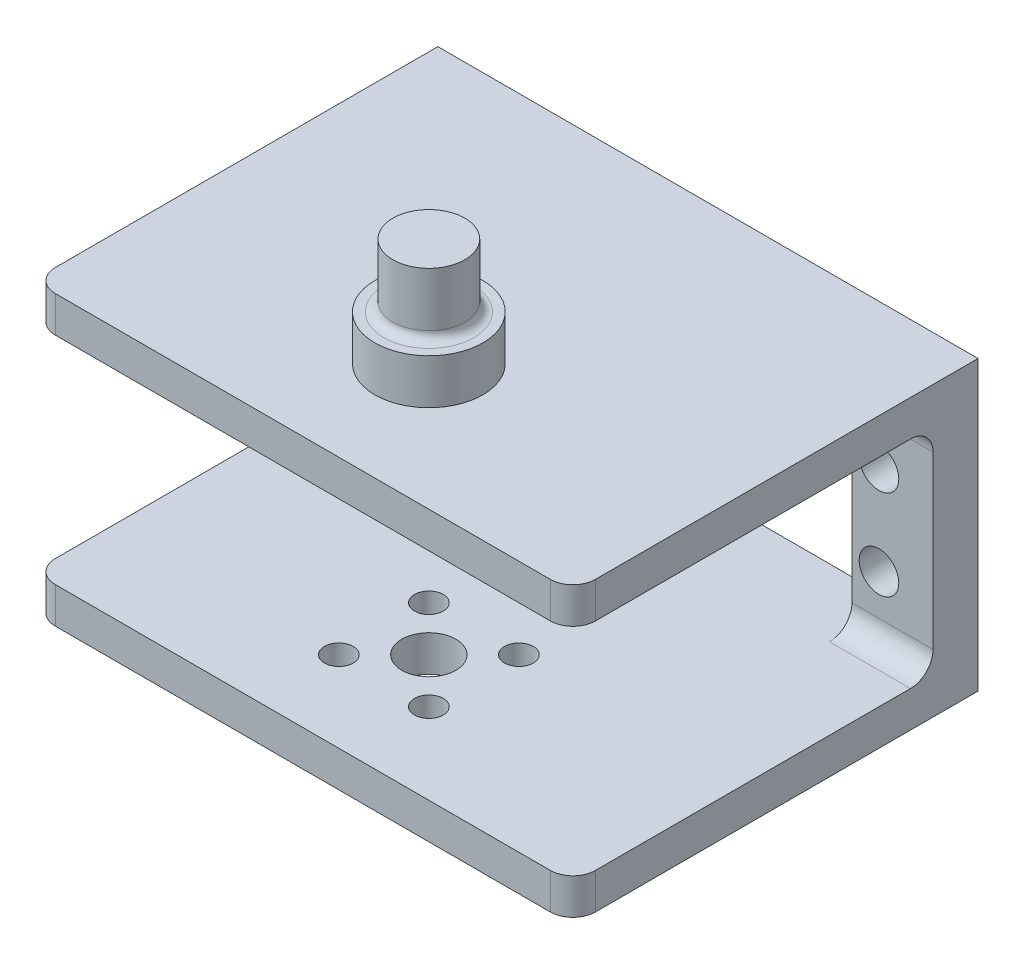
ISO-10303-21;
HEADER;
FILE_DESCRIPTION(('STEP AP214'),'2;1');
FILE_NAME('part.step','',(''),(''),'','','');
FILE_SCHEMA(('AUTOMOTIVE_DESIGN { 1 0 10303 214 1 1 1 1 }'));
ENDSEC;
DATA;
#1=APPLICATION_CONTEXT('core data for automotive mechanical design processes');
#2=APPLICATION_PROTOCOL_DEFINITION('international standard','automotive_design',2000,#1);
#3=PRODUCT_CONTEXT('',#1,'mechanical');
#4=PRODUCT('Part','Part','',(#3));
#5=PRODUCT_RELATED_PRODUCT_CATEGORY('part','',(#4));
#6=PRODUCT_DEFINITION_FORMATION('','',#4);
#7=PRODUCT_DEFINITION_CONTEXT('part definition',#1,'design');
#8=PRODUCT_DEFINITION('design','',#6,#7);
#9=PRODUCT_DEFINITION_SHAPE('','',#8);
#10=(LENGTH_UNIT() NAMED_UNIT(*) SI_UNIT(.MILLI.,.METRE.));
#11=(NAMED_UNIT(*) PLANE_ANGLE_UNIT() SI_UNIT($,.RADIAN.));
#12=(NAMED_UNIT(*) SI_UNIT($,.STERADIAN.) SOLID_ANGLE_UNIT());
#13=UNCERTAINTY_MEASURE_WITH_UNIT(LENGTH_MEASURE(1.E-05),#10,'distance_accuracy_value','');
#14=(GEOMETRIC_REPRESENTATION_CONTEXT(3) GLOBAL_UNCERTAINTY_ASSIGNED_CONTEXT((#13)) GLOBAL_UNIT_ASSIGNED_CONTEXT((#10,
#11,#12)) REPRESENTATION_CONTEXT('',''));
#15=CARTESIAN_POINT('',(0.,0.,0.));
#16=DIRECTION('',(0.,0.,1.));
#17=DIRECTION('',(1.,0.,0.));
#18=AXIS2_PLACEMENT_3D('',#15,#16,#17);
#19=CARTESIAN_POINT('',(0.,7.68517619511929,45.));
#20=DIRECTION('',(0.,1.,0.));
#21=DIRECTION('',(-1.,0.,0.));
#22=AXIS2_PLACEMENT_3D('',#19,#20,#21);
#23=PLANE('',#22);
#24=CARTESIAN_POINT('',(-87.025641025641,7.68517619511928,36.));
#25=DIRECTION('',(0.,1.,0.));
#26=DIRECTION('',(1.,0.,0.));
#27=AXIS2_PLACEMENT_3D('',#24,#25,#26);
#28=CIRCLE('',#27,1.60000000000001);
#29=CARTESIAN_POINT('',(-85.4256410256409,7.68517619511928,36.));
#30=VERTEX_POINT('',#29);
#31=EDGE_CURVE('E268',#30,#30,#28,.T.);
#32=ORIENTED_EDGE('',*,*,#31,.F.);
#33=EDGE_LOOP('',(#32));
#34=FACE_BOUND('',#33,.T.);
#35=CARTESIAN_POINT('',(-77.025641025641,7.68517619511928,36.));
#36=DIRECTION('',(0.,1.,0.));
#37=DIRECTION('',(1.,0.,0.));
#38=AXIS2_PLACEMENT_3D('',#35,#36,#37);
#39=CIRCLE('',#38,1.60000000000001);
#40=CARTESIAN_POINT('',(-75.4256410256409,7.68517619511928,36.));
#41=VERTEX_POINT('',#40);
#42=EDGE_CURVE('E260',#41,#41,#39,.T.);
#43=ORIENTED_EDGE('',*,*,#42,.F.);
#44=EDGE_LOOP('',(#43));
#45=FACE_BOUND('',#44,.T.);
#46=CARTESIAN_POINT('',(-87.025641025641,7.68517619511928,26.));
#47=DIRECTION('',(0.,1.,0.));
#48=DIRECTION('',(-1.,0.,0.));
#49=AXIS2_PLACEMENT_3D('',#46,#47,#48);
#50=CIRCLE('',#49,1.6);
#51=CARTESIAN_POINT('',(-88.625641025641,7.68517619511928,26.));
#52=VERTEX_POINT('',#51);
#53=EDGE_CURVE('E252',#52,#52,#50,.T.);
#54=ORIENTED_EDGE('',*,*,#53,.F.);
#55=EDGE_LOOP('',(#54));
#56=FACE_BOUND('',#55,.T.);
#57=CARTESIAN_POINT('',(-77.025641025641,7.68517619511928,26.));
#58=DIRECTION('',(0.,1.,0.));
#59=DIRECTION('',(-1.,0.,0.));
#60=AXIS2_PLACEMENT_3D('',#57,#58,#59);
#61=CIRCLE('',#60,1.6);
#62=CARTESIAN_POINT('',(-78.625641025641,7.68517619511928,26.));
#63=VERTEX_POINT('',#62);
#64=EDGE_CURVE('E243',#63,#63,#61,.T.);
#65=ORIENTED_EDGE('',*,*,#64,.F.);
#66=EDGE_LOOP('',(#65));
#67=FACE_BOUND('',#66,.T.);
#68=CARTESIAN_POINT('',(-82.025641025641,7.68517619511928,31.));
#69=DIRECTION('',(0.,1.,0.));
#70=DIRECTION('',(-1.,0.,0.));
#71=AXIS2_PLACEMENT_3D('',#68,#69,#70);
#72=CIRCLE('',#71,3.00000000000001);
#73=CARTESIAN_POINT('',(-85.025641025641,7.68517619511928,31.));
#74=VERTEX_POINT('',#73);
#75=EDGE_CURVE('E247',#74,#74,#72,.T.);
#76=ORIENTED_EDGE('',*,*,#75,.F.);
#77=EDGE_LOOP('',(#76));
#78=FACE_BOUND('',#77,.T.);
#79=DIRECTION('',(0.,0.,-1.));
#80=VECTOR('',#79,1.);
#81=CARTESIAN_POINT('',(-103.025641025641,7.68517619511928,5.));
#82=LINE('',#81,#80);
#83=CARTESIAN_POINT('',(-103.025641025641,7.68517619511928,7.5));
#84=VERTEX_POINT('',#83);
#85=CARTESIAN_POINT('',(-103.025641025641,7.68517619511928,0.));
#86=VERTEX_POINT('',#85);
#87=EDGE_CURVE('E333',#84,#86,#82,.T.);
#88=ORIENTED_EDGE('',*,*,#87,.F.);
#89=DIRECTION('',(1.,0.,0.));
#90=VECTOR('',#89,1.);
#91=CARTESIAN_POINT('',(-112.025641025641,7.68517619511928,7.5));
#92=LINE('',#91,#90);
#93=CARTESIAN_POINT('',(-112.025641025641,7.68517619511928,7.50000000000001));
#94=VERTEX_POINT('',#93);
#95=EDGE_CURVE('E438',#84,#94,#92,.F.);
#96=ORIENTED_EDGE('',*,*,#95,.T.);
#97=DIRECTION('',(0.,0.,-1.));
#98=VECTOR('',#97,1.);
#99=CARTESIAN_POINT('',(-112.025641025641,7.68517619511928,45.));
#100=LINE('',#99,#98);
#101=CARTESIAN_POINT('',(-112.025641025641,7.68517619511928,42.5));
#102=VERTEX_POINT('',#101);
#103=EDGE_CURVE('E373',#102,#94,#100,.T.);
#104=ORIENTED_EDGE('',*,*,#103,.F.);
#105=CARTESIAN_POINT('',(-109.525641025641,7.68517619511928,42.5));
#106=DIRECTION('',(0.,1.,0.));
#107=DIRECTION('',(-1.,0.,0.));
#108=AXIS2_PLACEMENT_3D('',#105,#106,#107);
#109=CIRCLE('',#108,2.5);
#110=CARTESIAN_POINT('',(-109.525641025641,7.68517619511928,45.));
#111=VERTEX_POINT('',#110);
#112=EDGE_CURVE('E421',#102,#111,#109,.T.);
#113=ORIENTED_EDGE('',*,*,#112,.T.);
#114=DIRECTION('',(1.,0.,0.));
#115=VECTOR('',#114,1.);
#116=CARTESIAN_POINT('',(0.,7.68517619511929,45.));
#117=LINE('',#116,#115);
#118=CARTESIAN_POINT('',(-54.525641025641,7.68517619511929,45.));
#119=VERTEX_POINT('',#118);
#120=EDGE_CURVE('E212',#111,#119,#117,.T.);
#121=ORIENTED_EDGE('',*,*,#120,.T.);
#122=CARTESIAN_POINT('',(-54.525641025641,7.68517619511929,42.5));
#123=DIRECTION('',(0.,1.,0.));
#124=DIRECTION('',(-1.,0.,0.));
#125=AXIS2_PLACEMENT_3D('',#122,#123,#124);
#126=CIRCLE('',#125,2.5);
#127=CARTESIAN_POINT('',(-52.025641025641,7.68517619511929,42.5));
#128=VERTEX_POINT('',#127);
#129=EDGE_CURVE('E424',#119,#128,#126,.T.);
#130=ORIENTED_EDGE('',*,*,#129,.T.);
#131=DIRECTION('',(0.,0.,-1.));
#132=VECTOR('',#131,1.);
#133=CARTESIAN_POINT('',(-52.025641025641,7.68517619511929,45.));
#134=LINE('',#133,#132);
#135=CARTESIAN_POINT('',(-52.025641025641,7.68517619511929,7.50000000000001));
#136=VERTEX_POINT('',#135);
#137=EDGE_CURVE('E357',#128,#136,#134,.T.);
#138=ORIENTED_EDGE('',*,*,#137,.T.);
#139=DIRECTION('',(1.,0.,0.));
#140=VECTOR('',#139,1.);
#141=CARTESIAN_POINT('',(-61.0256410256409,7.68517619511929,7.5));
#142=LINE('',#141,#140);
#143=CARTESIAN_POINT('',(-61.0256410256409,7.68517619511929,7.5));
#144=VERTEX_POINT('',#143);
#145=EDGE_CURVE('E434',#136,#144,#142,.F.);
#146=ORIENTED_EDGE('',*,*,#145,.T.);
#147=DIRECTION('',(0.,0.,-1.));
#148=VECTOR('',#147,1.);
#149=CARTESIAN_POINT('',(-61.0256410256409,7.68517619511929,5.));
#150=LINE('',#149,#148);
#151=CARTESIAN_POINT('',(-61.0256410256409,7.68517619511929,0.));
#152=VERTEX_POINT('',#151);
#153=EDGE_CURVE('E300',#144,#152,#150,.T.);
#154=ORIENTED_EDGE('',*,*,#153,.T.);
#155=DIRECTION('',(1.,0.,0.));
#156=VECTOR('',#155,1.);
#157=CARTESIAN_POINT('',(0.,7.68517619511929,0.));
#158=LINE('',#157,#156);
#159=EDGE_CURVE('E349',#86,#152,#158,.T.);
#160=ORIENTED_EDGE('',*,*,#159,.F.);
#161=EDGE_LOOP('',(#88,#96,#104,#113,#121,#130,#138,#146,#154,#160));
#162=FACE_BOUND('',#161,.T.);
#163=ADVANCED_FACE('F49',(#34,#45,#56,#67,#78,#162),#23,.T.);
#164=CARTESIAN_POINT('',(-112.025641025641,3.8866701879706E-13,45.));
#165=DIRECTION('',(1.,0.,0.));
#166=DIRECTION('',(0.,1.,0.));
#167=AXIS2_PLACEMENT_3D('',#164,#165,#166);
#168=PLANE('',#167);
#169=DIRECTION('',(0.,0.,-1.));
#170=VECTOR('',#169,1.);
#171=CARTESIAN_POINT('',(-112.025641025641,31.6851761951193,45.));
#172=LINE('',#171,#170);
#173=CARTESIAN_POINT('',(-112.025641025641,31.6851761951193,42.5));
#174=VERTEX_POINT('',#173);
#175=CARTESIAN_POINT('',(-112.025641025641,31.6851761951193,7.50000000000001));
#176=VERTEX_POINT('',#175);
#177=EDGE_CURVE('E233',#174,#176,#172,.T.);
#178=ORIENTED_EDGE('',*,*,#177,.F.);
#179=DIRECTION('',(0.,1.,0.));
#180=VECTOR('',#179,1.);
#181=CARTESIAN_POINT('',(-112.025641025641,35.6851761951193,42.5));
#182=LINE('',#181,#180);
#183=CARTESIAN_POINT('',(-112.025641025641,35.6851761951193,42.5));
#184=VERTEX_POINT('',#183);
#185=EDGE_CURVE('E404',#174,#184,#182,.T.);
#186=ORIENTED_EDGE('',*,*,#185,.T.);
#187=DIRECTION('',(0.,0.,-1.));
#188=VECTOR('',#187,1.);
#189=CARTESIAN_POINT('',(-112.025641025641,35.6851761951193,45.));
#190=LINE('',#189,#188);
#191=CARTESIAN_POINT('',(-112.025641025641,35.6851761951193,0.));
#192=VERTEX_POINT('',#191);
#193=EDGE_CURVE('E200',#184,#192,#190,.T.);
#194=ORIENTED_EDGE('',*,*,#193,.T.);
#195=DIRECTION('',(0.,-1.,0.));
#196=VECTOR('',#195,1.);
#197=CARTESIAN_POINT('',(-112.025641025641,3.8866701879706E-13,0.));
#198=LINE('',#197,#196);
#199=CARTESIAN_POINT('',(-112.025641025641,3.68517619511928,0.));
#200=VERTEX_POINT('',#199);
#201=EDGE_CURVE('E219',#192,#200,#198,.T.);
#202=ORIENTED_EDGE('',*,*,#201,.T.);
#203=DIRECTION('',(0.,0.,-1.));
#204=VECTOR('',#203,1.);
#205=CARTESIAN_POINT('',(-112.025641025641,3.68517619511928,45.));
#206=LINE('',#205,#204);
#207=CARTESIAN_POINT('',(-112.025641025641,3.68517619511928,42.5));
#208=VERTEX_POINT('',#207);
#209=EDGE_CURVE('E370',#208,#200,#206,.T.);
#210=ORIENTED_EDGE('',*,*,#209,.F.);
#211=DIRECTION('',(0.,-1.,0.));
#212=VECTOR('',#211,1.);
#213=CARTESIAN_POINT('',(-112.025641025641,7.68517619511928,42.5));
#214=LINE('',#213,#212);
#215=EDGE_CURVE('E401',#208,#102,#214,.F.);
#216=ORIENTED_EDGE('',*,*,#215,.T.);
#217=ORIENTED_EDGE('',*,*,#103,.T.);
#218=CARTESIAN_POINT('',(-112.025641025641,10.1851761951193,7.5));
#219=DIRECTION('',(1.,0.,0.));
#220=DIRECTION('',(0.,1.,0.));
#221=AXIS2_PLACEMENT_3D('',#218,#219,#220);
#222=CIRCLE('',#221,2.5);
#223=CARTESIAN_POINT('',(-112.025641025641,10.1851761951193,5.));
#224=VERTEX_POINT('',#223);
#225=EDGE_CURVE('E459',#94,#224,#222,.T.);
#226=ORIENTED_EDGE('',*,*,#225,.T.);
#227=DIRECTION('',(0.,1.,0.));
#228=VECTOR('',#227,1.);
#229=CARTESIAN_POINT('',(-112.025641025641,0.,5.));
#230=LINE('',#229,#228);
#231=CARTESIAN_POINT('',(-112.025641025641,29.1851761951193,5.));
#232=VERTEX_POINT('',#231);
#233=EDGE_CURVE('E329',#224,#232,#230,.T.);
#234=ORIENTED_EDGE('',*,*,#233,.T.);
#235=CARTESIAN_POINT('',(-112.025641025641,29.1851761951193,7.5));
#236=DIRECTION('',(1.,0.,0.));
#237=DIRECTION('',(0.,1.,0.));
#238=AXIS2_PLACEMENT_3D('',#235,#236,#237);
#239=CIRCLE('',#238,2.5);
#240=EDGE_CURVE('E477',#232,#176,#239,.T.);
#241=ORIENTED_EDGE('',*,*,#240,.T.);
#242=EDGE_LOOP('',(#178,#186,#194,#202,#210,#216,#217,#226,#234,#241));
#243=FACE_BOUND('',#242,.T.);
#244=ADVANCED_FACE('F495',(#243),#168,.F.);
#245=CARTESIAN_POINT('',(0.,3.68517619511929,45.));
#246=DIRECTION('',(0.,1.,0.));
#247=DIRECTION('',(-1.,0.,0.));
#248=AXIS2_PLACEMENT_3D('',#245,#246,#247);
#249=PLANE('',#248);
#250=CARTESIAN_POINT('',(-87.025641025641,3.68517619511928,36.));
#251=DIRECTION('',(0.,1.,0.));
#252=DIRECTION('',(1.,0.,0.));
#253=AXIS2_PLACEMENT_3D('',#250,#251,#252);
#254=CIRCLE('',#253,1.60000000000001);
#255=CARTESIAN_POINT('',(-85.4256410256409,3.68517619511928,36.));
#256=VERTEX_POINT('',#255);
#257=EDGE_CURVE('E242',#256,#256,#254,.T.);
#258=ORIENTED_EDGE('',*,*,#257,.T.);
#259=EDGE_LOOP('',(#258));
#260=FACE_BOUND('',#259,.T.);
#261=CARTESIAN_POINT('',(-77.025641025641,3.68517619511928,36.));
#262=DIRECTION('',(0.,1.,0.));
#263=DIRECTION('',(1.,0.,0.));
#264=AXIS2_PLACEMENT_3D('',#261,#262,#263);
#265=CIRCLE('',#264,1.60000000000001);
#266=CARTESIAN_POINT('',(-75.4256410256409,3.68517619511928,36.));
#267=VERTEX_POINT('',#266);
#268=EDGE_CURVE('E264',#267,#267,#265,.T.);
#269=ORIENTED_EDGE('',*,*,#268,.T.);
#270=EDGE_LOOP('',(#269));
#271=FACE_BOUND('',#270,.T.);
#272=CARTESIAN_POINT('',(-87.025641025641,3.68517619511928,26.));
#273=DIRECTION('',(0.,1.,0.));
#274=DIRECTION('',(-1.,0.,0.));
#275=AXIS2_PLACEMENT_3D('',#272,#273,#274);
#276=CIRCLE('',#275,1.6);
#277=CARTESIAN_POINT('',(-88.625641025641,3.68517619511928,26.));
#278=VERTEX_POINT('',#277);
#279=EDGE_CURVE('E256',#278,#278,#276,.T.);
#280=ORIENTED_EDGE('',*,*,#279,.T.);
#281=EDGE_LOOP('',(#280));
#282=FACE_BOUND('',#281,.T.);
#283=CARTESIAN_POINT('',(-77.025641025641,3.68517619511928,26.));
#284=DIRECTION('',(0.,1.,0.));
#285=DIRECTION('',(-1.,0.,0.));
#286=AXIS2_PLACEMENT_3D('',#283,#284,#285);
#287=CIRCLE('',#286,1.6);
#288=CARTESIAN_POINT('',(-78.625641025641,3.68517619511928,26.));
#289=VERTEX_POINT('',#288);
#290=EDGE_CURVE('E248',#289,#289,#287,.T.);
#291=ORIENTED_EDGE('',*,*,#290,.T.);
#292=EDGE_LOOP('',(#291));
#293=FACE_BOUND('',#292,.T.);
#294=CARTESIAN_POINT('',(-82.025641025641,3.68517619511928,31.));
#295=DIRECTION('',(0.,1.,0.));
#296=DIRECTION('',(-1.,0.,0.));
#297=AXIS2_PLACEMENT_3D('',#294,#295,#296);
#298=CIRCLE('',#297,3.00000000000001);
#299=CARTESIAN_POINT('',(-85.025641025641,3.68517619511928,31.));
#300=VERTEX_POINT('',#299);
#301=EDGE_CURVE('E275',#300,#300,#298,.T.);
#302=ORIENTED_EDGE('',*,*,#301,.T.);
#303=EDGE_LOOP('',(#302));
#304=FACE_BOUND('',#303,.T.);
#305=DIRECTION('',(0.,0.,-1.));
#306=VECTOR('',#305,1.);
#307=CARTESIAN_POINT('',(-52.0256410256409,3.68517619511929,45.));
#308=LINE('',#307,#306);
#309=CARTESIAN_POINT('',(-52.0256410256409,3.68517619511929,42.5));
#310=VERTEX_POINT('',#309);
#311=CARTESIAN_POINT('',(-52.0256410256409,3.68517619511929,0.));
#312=VERTEX_POINT('',#311);
#313=EDGE_CURVE('E207',#310,#312,#308,.T.);
#314=ORIENTED_EDGE('',*,*,#313,.F.);
#315=CARTESIAN_POINT('',(-54.5256410256409,3.68517619511929,42.5));
#316=DIRECTION('',(0.,1.,0.));
#317=DIRECTION('',(-1.,0.,0.));
#318=AXIS2_PLACEMENT_3D('',#315,#316,#317);
#319=CIRCLE('',#318,2.5);
#320=CARTESIAN_POINT('',(-54.5256410256409,3.68517619511929,45.));
#321=VERTEX_POINT('',#320);
#322=EDGE_CURVE('E411',#310,#321,#319,.F.);
#323=ORIENTED_EDGE('',*,*,#322,.T.);
#324=DIRECTION('',(1.,0.,0.));
#325=VECTOR('',#324,1.);
#326=CARTESIAN_POINT('',(0.,3.68517619511929,45.));
#327=LINE('',#326,#325);
#328=CARTESIAN_POINT('',(-109.525641025641,3.68517619511928,45.));
#329=VERTEX_POINT('',#328);
#330=EDGE_CURVE('E353',#329,#321,#327,.T.);
#331=ORIENTED_EDGE('',*,*,#330,.F.);
#332=CARTESIAN_POINT('',(-109.525641025641,3.68517619511928,42.5));
#333=DIRECTION('',(0.,1.,0.));
#334=DIRECTION('',(-1.,0.,0.));
#335=AXIS2_PLACEMENT_3D('',#332,#333,#334);
#336=CIRCLE('',#335,2.5);
#337=EDGE_CURVE('E408',#329,#208,#336,.F.);
#338=ORIENTED_EDGE('',*,*,#337,.T.);
#339=ORIENTED_EDGE('',*,*,#209,.T.);
#340=DIRECTION('',(1.,0.,0.));
#341=VECTOR('',#340,1.);
#342=CARTESIAN_POINT('',(0.,3.68517619511929,0.));
#343=LINE('',#342,#341);
#344=EDGE_CURVE('E213',#200,#312,#343,.T.);
#345=ORIENTED_EDGE('',*,*,#344,.T.);
#346=EDGE_LOOP('',(#314,#323,#331,#338,#339,#345));
#347=FACE_BOUND('',#346,.T.);
#348=ADVANCED_FACE('F502',(#260,#271,#282,#293,#304,#347),#249,.F.);
#349=CARTESIAN_POINT('',(-52.0256410256409,-1.80500201679843E-13,45.));
#350=DIRECTION('',(1.,0.,0.));
#351=DIRECTION('',(0.,1.,0.));
#352=AXIS2_PLACEMENT_3D('',#349,#350,#351);
#353=PLANE('',#352);
#354=DIRECTION('',(0.,0.,-1.));
#355=VECTOR('',#354,1.);
#356=CARTESIAN_POINT('',(-52.0256410256409,35.6851761951193,45.));
#357=LINE('',#356,#355);
#358=CARTESIAN_POINT('',(-52.0256410256409,35.6851761951193,42.5));
#359=VERTEX_POINT('',#358);
#360=CARTESIAN_POINT('',(-52.0256410256409,35.6851761951193,0.));
#361=VERTEX_POINT('',#360);
#362=EDGE_CURVE('E188',#359,#361,#357,.T.);
#363=ORIENTED_EDGE('',*,*,#362,.F.);
#364=DIRECTION('',(0.,1.,0.));
#365=VECTOR('',#364,1.);
#366=CARTESIAN_POINT('',(-52.0256410256409,-1.80500201679843E-13,42.5));
#367=LINE('',#366,#365);
#368=CARTESIAN_POINT('',(-52.0256410256409,31.6851761951193,42.5));
#369=VERTEX_POINT('',#368);
#370=EDGE_CURVE('E392',#359,#369,#367,.F.);
#371=ORIENTED_EDGE('',*,*,#370,.T.);
#372=DIRECTION('',(0.,0.,-1.));
#373=VECTOR('',#372,1.);
#374=CARTESIAN_POINT('',(-52.0256410256409,31.6851761951193,45.));
#375=LINE('',#374,#373);
#376=CARTESIAN_POINT('',(-52.0256410256409,31.6851761951193,7.50000000000001));
#377=VERTEX_POINT('',#376);
#378=EDGE_CURVE('E199',#369,#377,#375,.T.);
#379=ORIENTED_EDGE('',*,*,#378,.T.);
#380=CARTESIAN_POINT('',(-52.025641025641,29.1851761951193,7.5));
#381=DIRECTION('',(1.,0.,0.));
#382=DIRECTION('',(0.,1.,0.));
#383=AXIS2_PLACEMENT_3D('',#380,#381,#382);
#384=CIRCLE('',#383,2.5);
#385=CARTESIAN_POINT('',(-52.0256410256409,29.1851761951193,5.));
#386=VERTEX_POINT('',#385);
#387=EDGE_CURVE('E468',#377,#386,#384,.F.);
#388=ORIENTED_EDGE('',*,*,#387,.T.);
#389=DIRECTION('',(0.,1.,0.));
#390=VECTOR('',#389,1.);
#391=CARTESIAN_POINT('',(-52.025641025641,0.,5.));
#392=LINE('',#391,#390);
#393=CARTESIAN_POINT('',(-52.0256410256409,10.1851761951193,5.));
#394=VERTEX_POINT('',#393);
#395=EDGE_CURVE('E287',#394,#386,#392,.T.);
#396=ORIENTED_EDGE('',*,*,#395,.F.);
#397=CARTESIAN_POINT('',(-52.025641025641,10.1851761951193,7.5));
#398=DIRECTION('',(1.,0.,0.));
#399=DIRECTION('',(0.,1.,0.));
#400=AXIS2_PLACEMENT_3D('',#397,#398,#399);
#401=CIRCLE('',#400,2.5);
#402=EDGE_CURVE('E462',#394,#136,#401,.F.);
#403=ORIENTED_EDGE('',*,*,#402,.T.);
#404=ORIENTED_EDGE('',*,*,#137,.F.);
#405=DIRECTION('',(0.,-1.,0.));
#406=VECTOR('',#405,1.);
#407=CARTESIAN_POINT('',(-52.0256410256409,-1.80500201679843E-13,42.5));
#408=LINE('',#407,#406);
#409=EDGE_CURVE('E389',#128,#310,#408,.T.);
#410=ORIENTED_EDGE('',*,*,#409,.T.);
#411=ORIENTED_EDGE('',*,*,#313,.T.);
#412=DIRECTION('',(0.,-1.,0.));
#413=VECTOR('',#412,1.);
#414=CARTESIAN_POINT('',(-52.0256410256409,-1.80500201679843E-13,0.));
#415=LINE('',#414,#413);
#416=EDGE_CURVE('E203',#361,#312,#415,.T.);
#417=ORIENTED_EDGE('',*,*,#416,.F.);
#418=EDGE_LOOP('',(#363,#371,#379,#388,#396,#403,#404,#410,#411,#417));
#419=FACE_BOUND('',#418,.T.);
#420=ADVANCED_FACE('F204',(#419),#353,.T.);
#421=CARTESIAN_POINT('',(0.,0.,45.));
#422=DIRECTION('',(0.,0.,1.));
#423=DIRECTION('',(1.,0.,0.));
#424=AXIS2_PLACEMENT_3D('',#421,#422,#423);
#425=PLANE('',#424);
#426=ORIENTED_EDGE('',*,*,#330,.T.);
#427=DIRECTION('',(0.,-1.,0.));
#428=VECTOR('',#427,1.);
#429=CARTESIAN_POINT('',(-54.5256410256409,-1.89173819059727E-13,45.));
#430=LINE('',#429,#428);
#431=EDGE_CURVE('E418',#321,#119,#430,.F.);
#432=ORIENTED_EDGE('',*,*,#431,.T.);
#433=ORIENTED_EDGE('',*,*,#120,.F.);
#434=DIRECTION('',(0.,-1.,0.));
#435=VECTOR('',#434,1.);
#436=CARTESIAN_POINT('',(-109.525641025641,3.68517619511927,45.));
#437=LINE('',#436,#435);
#438=EDGE_CURVE('E414',#111,#329,#437,.T.);
#439=ORIENTED_EDGE('',*,*,#438,.T.);
#440=EDGE_LOOP('',(#426,#432,#433,#439));
#441=FACE_BOUND('',#440,.T.);
#442=ADVANCED_FACE('F637',(#441),#425,.T.);
#443=CARTESIAN_POINT('',(0.,0.,0.));
#444=DIRECTION('',(0.,0.,1.));
#445=DIRECTION('',(1.,0.,0.));
#446=AXIS2_PLACEMENT_3D('',#443,#444,#445);
#447=PLANE('',#446);
#448=DIRECTION('',(1.,0.,0.));
#449=VECTOR('',#448,1.);
#450=CARTESIAN_POINT('',(0.,31.6851761951193,0.));
#451=LINE('',#450,#449);
#452=CARTESIAN_POINT('',(-103.025641025641,31.6851761951193,0.));
#453=VERTEX_POINT('',#452);
#454=CARTESIAN_POINT('',(-61.0256410256409,31.6851761951193,0.));
#455=VERTEX_POINT('',#454);
#456=EDGE_CURVE('E222',#453,#455,#451,.T.);
#457=ORIENTED_EDGE('',*,*,#456,.F.);
#458=DIRECTION('',(0.,-1.,0.));
#459=VECTOR('',#458,1.);
#460=CARTESIAN_POINT('',(-103.025641025641,-9.53178656611939E-13,0.));
#461=LINE('',#460,#459);
#462=EDGE_CURVE('E321',#453,#86,#461,.T.);
#463=ORIENTED_EDGE('',*,*,#462,.T.);
#464=ORIENTED_EDGE('',*,*,#159,.T.);
#465=DIRECTION('',(0.,-1.,0.));
#466=VECTOR('',#465,1.);
#467=CARTESIAN_POINT('',(-61.0256410256409,0.,0.));
#468=LINE('',#467,#466);
#469=EDGE_CURVE('E304',#455,#152,#468,.T.);
#470=ORIENTED_EDGE('',*,*,#469,.F.);
#471=EDGE_LOOP('',(#457,#463,#464,#470));
#472=FACE_BOUND('',#471,.T.);
#473=ORIENTED_EDGE('',*,*,#201,.F.);
#474=DIRECTION('',(1.,0.,0.));
#475=VECTOR('',#474,1.);
#476=CARTESIAN_POINT('',(0.,35.6851761951193,0.));
#477=LINE('',#476,#475);
#478=EDGE_CURVE('E194',#192,#361,#477,.T.);
#479=ORIENTED_EDGE('',*,*,#478,.T.);
#480=ORIENTED_EDGE('',*,*,#416,.T.);
#481=ORIENTED_EDGE('',*,*,#344,.F.);
#482=EDGE_LOOP('',(#473,#479,#480,#481));
#483=FACE_BOUND('',#482,.T.);
#484=CARTESIAN_POINT('',(-106.025641025641,14.6851761951193,0.));
#485=DIRECTION('',(0.,0.,1.));
#486=DIRECTION('',(1.,0.,0.));
#487=AXIS2_PLACEMENT_3D('',#484,#485,#486);
#488=CIRCLE('',#487,2.20000000000001);
#489=CARTESIAN_POINT('',(-103.825641025641,14.6851761951193,0.));
#490=VERTEX_POINT('',#489);
#491=EDGE_CURVE('E315',#490,#490,#488,.T.);
#492=ORIENTED_EDGE('',*,*,#491,.T.);
#493=EDGE_LOOP('',(#492));
#494=FACE_BOUND('',#493,.T.);
#495=CARTESIAN_POINT('',(-106.025641025641,24.6851761951193,0.));
#496=DIRECTION('',(0.,0.,1.));
#497=DIRECTION('',(1.,0.,0.));
#498=AXIS2_PLACEMENT_3D('',#495,#496,#497);
#499=CIRCLE('',#498,2.2);
#500=CARTESIAN_POINT('',(-103.825641025641,24.6851761951193,0.));
#501=VERTEX_POINT('',#500);
#502=EDGE_CURVE('E337',#501,#501,#499,.T.);
#503=ORIENTED_EDGE('',*,*,#502,.T.);
#504=EDGE_LOOP('',(#503));
#505=FACE_BOUND('',#504,.T.);
#506=CARTESIAN_POINT('',(-58.0256410256409,14.6851761951193,0.));
#507=DIRECTION('',(0.,0.,1.));
#508=DIRECTION('',(1.,0.,0.));
#509=AXIS2_PLACEMENT_3D('',#506,#507,#508);
#510=CIRCLE('',#509,2.20000000000001);
#511=CARTESIAN_POINT('',(-55.8256410256409,14.6851761951193,0.));
#512=VERTEX_POINT('',#511);
#513=EDGE_CURVE('E279',#512,#512,#510,.F.);
#514=ORIENTED_EDGE('',*,*,#513,.F.);
#515=EDGE_LOOP('',(#514));
#516=FACE_BOUND('',#515,.T.);
#517=CARTESIAN_POINT('',(-58.025641025641,24.6851761951193,0.));
#518=DIRECTION('',(0.,0.,1.));
#519=DIRECTION('',(1.,0.,0.));
#520=AXIS2_PLACEMENT_3D('',#517,#518,#519);
#521=CIRCLE('',#520,2.2);
#522=CARTESIAN_POINT('',(-55.825641025641,24.6851761951193,0.));
#523=VERTEX_POINT('',#522);
#524=EDGE_CURVE('E288',#523,#523,#521,.F.);
#525=ORIENTED_EDGE('',*,*,#524,.F.);
#526=EDGE_LOOP('',(#525));
#527=FACE_BOUND('',#526,.T.);
#528=ADVANCED_FACE('F216',(#472,#483,#494,#505,#516,#527),#447,.F.);
#529=CARTESIAN_POINT('',(-103.025641025641,-9.53178656611939E-13,5.));
#530=DIRECTION('',(1.,0.,0.));
#531=DIRECTION('',(0.,1.,0.));
#532=AXIS2_PLACEMENT_3D('',#529,#530,#531);
#533=PLANE('',#532);
#534=ORIENTED_EDGE('',*,*,#462,.F.);
#535=DIRECTION('',(0.,0.,-1.));
#536=VECTOR('',#535,1.);
#537=CARTESIAN_POINT('',(-103.025641025641,31.6851761951193,5.));
#538=LINE('',#537,#536);
#539=CARTESIAN_POINT('',(-103.025641025641,31.6851761951193,7.5));
#540=VERTEX_POINT('',#539);
#541=EDGE_CURVE('E73',#540,#453,#538,.T.);
#542=ORIENTED_EDGE('',*,*,#541,.F.);
#543=CARTESIAN_POINT('',(-103.025641025641,29.1851761951193,7.5));
#544=DIRECTION('',(1.,0.,0.));
#545=DIRECTION('',(0.,1.,0.));
#546=AXIS2_PLACEMENT_3D('',#543,#544,#545);
#547=CIRCLE('',#546,2.5);
#548=CARTESIAN_POINT('',(-103.025641025641,29.1851761951193,5.));
#549=VERTEX_POINT('',#548);
#550=EDGE_CURVE('E474',#540,#549,#547,.F.);
#551=ORIENTED_EDGE('',*,*,#550,.T.);
#552=DIRECTION('',(0.,-1.,0.));
#553=VECTOR('',#552,1.);
#554=CARTESIAN_POINT('',(-103.025641025641,-9.53178656611939E-13,5.));
#555=LINE('',#554,#553);
#556=CARTESIAN_POINT('',(-103.025641025641,10.1851761951193,5.));
#557=VERTEX_POINT('',#556);
#558=EDGE_CURVE('E325',#549,#557,#555,.T.);
#559=ORIENTED_EDGE('',*,*,#558,.T.);
#560=CARTESIAN_POINT('',(-103.025641025641,10.1851761951193,7.5));
#561=DIRECTION('',(1.,0.,0.));
#562=DIRECTION('',(0.,1.,0.));
#563=AXIS2_PLACEMENT_3D('',#560,#561,#562);
#564=CIRCLE('',#563,2.5);
#565=EDGE_CURVE('E455',#557,#84,#564,.F.);
#566=ORIENTED_EDGE('',*,*,#565,.T.);
#567=ORIENTED_EDGE('',*,*,#87,.T.);
#568=EDGE_LOOP('',(#534,#542,#551,#559,#566,#567));
#569=FACE_BOUND('',#568,.T.);
#570=ADVANCED_FACE('F627',(#569),#533,.T.);
#571=CARTESIAN_POINT('',(-106.025641025641,24.6851761951193,5.));
#572=DIRECTION('',(0.,0.,-1.));
#573=DIRECTION('',(-1.,0.,0.));
#574=AXIS2_PLACEMENT_3D('',#571,#572,#573);
#575=CYLINDRICAL_SURFACE('',#574,2.2);
#576=CARTESIAN_POINT('',(-106.025641025641,24.6851761951193,5.));
#577=DIRECTION('',(0.,0.,1.));
#578=DIRECTION('',(1.,0.,0.));
#579=AXIS2_PLACEMENT_3D('',#576,#577,#578);
#580=CIRCLE('',#579,2.2);
#581=CARTESIAN_POINT('',(-103.825641025641,24.6851761951193,5.));
#582=VERTEX_POINT('',#581);
#583=EDGE_CURVE('E320',#582,#582,#580,.T.);
#584=ORIENTED_EDGE('',*,*,#583,.T.);
#585=EDGE_LOOP('',(#584));
#586=FACE_BOUND('',#585,.T.);
#587=ORIENTED_EDGE('',*,*,#502,.F.);
#588=EDGE_LOOP('',(#587));
#589=FACE_BOUND('',#588,.T.);
#590=ADVANCED_FACE('F630',(#586,#589),#575,.F.);
#591=CARTESIAN_POINT('',(-106.025641025641,14.6851761951193,5.));
#592=DIRECTION('',(0.,0.,-1.));
#593=DIRECTION('',(-1.,0.,0.));
#594=AXIS2_PLACEMENT_3D('',#591,#592,#593);
#595=CYLINDRICAL_SURFACE('',#594,2.20000000000001);
#596=CARTESIAN_POINT('',(-106.025641025641,14.6851761951193,5.));
#597=DIRECTION('',(0.,0.,1.));
#598=DIRECTION('',(1.,0.,0.));
#599=AXIS2_PLACEMENT_3D('',#596,#597,#598);
#600=CIRCLE('',#599,2.20000000000001);
#601=CARTESIAN_POINT('',(-103.825641025641,14.6851761951193,5.));
#602=VERTEX_POINT('',#601);
#603=EDGE_CURVE('E316',#602,#602,#600,.T.);
#604=ORIENTED_EDGE('',*,*,#603,.T.);
#605=EDGE_LOOP('',(#604));
#606=FACE_BOUND('',#605,.T.);
#607=ORIENTED_EDGE('',*,*,#491,.F.);
#608=EDGE_LOOP('',(#607));
#609=FACE_BOUND('',#608,.T.);
#610=ADVANCED_FACE('F625',(#606,#609),#595,.F.);
#611=CARTESIAN_POINT('',(0.,0.,5.));
#612=DIRECTION('',(0.,0.,1.));
#613=DIRECTION('',(1.,0.,0.));
#614=AXIS2_PLACEMENT_3D('',#611,#612,#613);
#615=PLANE('',#614);
#616=ORIENTED_EDGE('',*,*,#603,.F.);
#617=EDGE_LOOP('',(#616));
#618=FACE_BOUND('',#617,.T.);
#619=ORIENTED_EDGE('',*,*,#583,.F.);
#620=EDGE_LOOP('',(#619));
#621=FACE_BOUND('',#620,.T.);
#622=ORIENTED_EDGE('',*,*,#233,.F.);
#623=DIRECTION('',(1.,0.,0.));
#624=VECTOR('',#623,1.);
#625=CARTESIAN_POINT('',(-103.025641025641,10.1851761951193,5.));
#626=LINE('',#625,#624);
#627=EDGE_CURVE('E430',#224,#557,#626,.T.);
#628=ORIENTED_EDGE('',*,*,#627,.T.);
#629=ORIENTED_EDGE('',*,*,#558,.F.);
#630=DIRECTION('',(1.,0.,0.));
#631=VECTOR('',#630,1.);
#632=CARTESIAN_POINT('',(0.,29.1851761951193,5.));
#633=LINE('',#632,#631);
#634=EDGE_CURVE('E427',#549,#232,#633,.F.);
#635=ORIENTED_EDGE('',*,*,#634,.T.);
#636=EDGE_LOOP('',(#622,#628,#629,#635));
#637=FACE_BOUND('',#636,.T.);
#638=ADVANCED_FACE('F618',(#618,#621,#637),#615,.T.);
#639=CARTESIAN_POINT('',(-61.0256410256409,0.,5.));
#640=DIRECTION('',(1.,0.,0.));
#641=DIRECTION('',(0.,0.,-1.));
#642=AXIS2_PLACEMENT_3D('',#639,#640,#641);
#643=PLANE('',#642);
#644=ORIENTED_EDGE('',*,*,#469,.T.);
#645=ORIENTED_EDGE('',*,*,#153,.F.);
#646=CARTESIAN_POINT('',(-61.0256410256409,10.1851761951193,7.5));
#647=DIRECTION('',(1.,0.,0.));
#648=DIRECTION('',(0.,0.,-1.));
#649=AXIS2_PLACEMENT_3D('',#646,#647,#648);
#650=CIRCLE('',#649,2.5);
#651=CARTESIAN_POINT('',(-61.0256410256409,10.1851761951193,5.));
#652=VERTEX_POINT('',#651);
#653=EDGE_CURVE('E465',#144,#652,#650,.T.);
#654=ORIENTED_EDGE('',*,*,#653,.T.);
#655=DIRECTION('',(0.,-1.,0.));
#656=VECTOR('',#655,1.);
#657=CARTESIAN_POINT('',(-61.0256410256409,0.,5.));
#658=LINE('',#657,#656);
#659=CARTESIAN_POINT('',(-61.0256410256409,29.1851761951193,5.));
#660=VERTEX_POINT('',#659);
#661=EDGE_CURVE('E292',#660,#652,#658,.T.);
#662=ORIENTED_EDGE('',*,*,#661,.F.);
#663=CARTESIAN_POINT('',(-61.0256410256409,29.1851761951193,7.5));
#664=DIRECTION('',(1.,0.,0.));
#665=DIRECTION('',(0.,0.,-1.));
#666=AXIS2_PLACEMENT_3D('',#663,#664,#665);
#667=CIRCLE('',#666,2.5);
#668=CARTESIAN_POINT('',(-61.0256410256409,31.6851761951193,7.5));
#669=VERTEX_POINT('',#668);
#670=EDGE_CURVE('E471',#660,#669,#667,.T.);
#671=ORIENTED_EDGE('',*,*,#670,.T.);
#672=DIRECTION('',(0.,0.,-1.));
#673=VECTOR('',#672,1.);
#674=CARTESIAN_POINT('',(-61.0256410256409,31.6851761951193,5.));
#675=LINE('',#674,#673);
#676=EDGE_CURVE('E65',#669,#455,#675,.T.);
#677=ORIENTED_EDGE('',*,*,#676,.T.);
#678=EDGE_LOOP('',(#644,#645,#654,#662,#671,#677));
#679=FACE_BOUND('',#678,.T.);
#680=ADVANCED_FACE('F615',(#679),#643,.F.);
#681=CARTESIAN_POINT('',(-58.0256410256409,14.6851761951193,5.));
#682=DIRECTION('',(0.,0.,-1.));
#683=DIRECTION('',(-1.,0.,0.));
#684=AXIS2_PLACEMENT_3D('',#681,#682,#683);
#685=CYLINDRICAL_SURFACE('',#684,2.20000000000001);
#686=CARTESIAN_POINT('',(-58.0256410256409,14.6851761951193,5.));
#687=DIRECTION('',(0.,0.,1.));
#688=DIRECTION('',(1.,0.,0.));
#689=AXIS2_PLACEMENT_3D('',#686,#687,#688);
#690=CIRCLE('',#689,2.20000000000001);
#691=CARTESIAN_POINT('',(-55.8256410256409,14.6851761951193,5.));
#692=VERTEX_POINT('',#691);
#693=EDGE_CURVE('E283',#692,#692,#690,.F.);
#694=ORIENTED_EDGE('',*,*,#693,.F.);
#695=EDGE_LOOP('',(#694));
#696=FACE_BOUND('',#695,.T.);
#697=ORIENTED_EDGE('',*,*,#513,.T.);
#698=EDGE_LOOP('',(#697));
#699=FACE_BOUND('',#698,.T.);
#700=ADVANCED_FACE('F613',(#696,#699),#685,.F.);
#701=CARTESIAN_POINT('',(-58.025641025641,24.6851761951193,5.));
#702=DIRECTION('',(0.,0.,-1.));
#703=DIRECTION('',(-1.,0.,0.));
#704=AXIS2_PLACEMENT_3D('',#701,#702,#703);
#705=CYLINDRICAL_SURFACE('',#704,2.2);
#706=CARTESIAN_POINT('',(-58.025641025641,24.6851761951193,5.));
#707=DIRECTION('',(0.,0.,1.));
#708=DIRECTION('',(1.,0.,0.));
#709=AXIS2_PLACEMENT_3D('',#706,#707,#708);
#710=CIRCLE('',#709,2.2);
#711=CARTESIAN_POINT('',(-55.825641025641,24.6851761951193,5.));
#712=VERTEX_POINT('',#711);
#713=EDGE_CURVE('E296',#712,#712,#710,.F.);
#714=ORIENTED_EDGE('',*,*,#713,.F.);
#715=EDGE_LOOP('',(#714));
#716=FACE_BOUND('',#715,.T.);
#717=ORIENTED_EDGE('',*,*,#524,.T.);
#718=EDGE_LOOP('',(#717));
#719=FACE_BOUND('',#718,.T.);
#720=ADVANCED_FACE('F609',(#716,#719),#705,.F.);
#721=CARTESIAN_POINT('',(0.,0.,5.));
#722=DIRECTION('',(0.,0.,1.));
#723=DIRECTION('',(1.,0.,0.));
#724=AXIS2_PLACEMENT_3D('',#721,#722,#723);
#725=PLANE('',#724);
#726=ORIENTED_EDGE('',*,*,#693,.T.);
#727=EDGE_LOOP('',(#726));
#728=FACE_BOUND('',#727,.T.);
#729=ORIENTED_EDGE('',*,*,#661,.T.);
#730=DIRECTION('',(1.,0.,0.));
#731=VECTOR('',#730,1.);
#732=CARTESIAN_POINT('',(-52.025641025641,10.1851761951193,5.));
#733=LINE('',#732,#731);
#734=EDGE_CURVE('E444',#652,#394,#733,.T.);
#735=ORIENTED_EDGE('',*,*,#734,.T.);
#736=ORIENTED_EDGE('',*,*,#395,.T.);
#737=DIRECTION('',(1.,0.,0.));
#738=VECTOR('',#737,1.);
#739=CARTESIAN_POINT('',(0.,29.1851761951193,5.));
#740=LINE('',#739,#738);
#741=EDGE_CURVE('E441',#386,#660,#740,.F.);
#742=ORIENTED_EDGE('',*,*,#741,.T.);
#743=EDGE_LOOP('',(#729,#735,#736,#742));
#744=FACE_BOUND('',#743,.T.);
#745=ORIENTED_EDGE('',*,*,#713,.T.);
#746=EDGE_LOOP('',(#745));
#747=FACE_BOUND('',#746,.T.);
#748=ADVANCED_FACE('F605',(#728,#744,#747),#725,.T.);
#749=CARTESIAN_POINT('',(-82.025641025641,3.68517619511928,31.));
#750=DIRECTION('',(0.,1.,0.));
#751=DIRECTION('',(-1.,0.,0.));
#752=AXIS2_PLACEMENT_3D('',#749,#750,#751);
#753=CYLINDRICAL_SURFACE('',#752,3.00000000000001);
#754=ORIENTED_EDGE('',*,*,#301,.F.);
#755=EDGE_LOOP('',(#754));
#756=FACE_BOUND('',#755,.T.);
#757=ORIENTED_EDGE('',*,*,#75,.T.);
#758=EDGE_LOOP('',(#757));
#759=FACE_BOUND('',#758,.T.);
#760=ADVANCED_FACE('F591',(#756,#759),#753,.F.);
#761=CARTESIAN_POINT('',(-77.025641025641,3.68517619511928,26.));
#762=DIRECTION('',(0.,1.,0.));
#763=DIRECTION('',(-1.,0.,0.));
#764=AXIS2_PLACEMENT_3D('',#761,#762,#763);
#765=CYLINDRICAL_SURFACE('',#764,1.6);
#766=ORIENTED_EDGE('',*,*,#290,.F.);
#767=EDGE_LOOP('',(#766));
#768=FACE_BOUND('',#767,.T.);
#769=ORIENTED_EDGE('',*,*,#64,.T.);
#770=EDGE_LOOP('',(#769));
#771=FACE_BOUND('',#770,.T.);
#772=ADVANCED_FACE('F587',(#768,#771),#765,.F.);
#773=CARTESIAN_POINT('',(-87.025641025641,3.68517619511928,26.));
#774=DIRECTION('',(0.,1.,0.));
#775=DIRECTION('',(-1.,0.,0.));
#776=AXIS2_PLACEMENT_3D('',#773,#774,#775);
#777=CYLINDRICAL_SURFACE('',#776,1.6);
#778=ORIENTED_EDGE('',*,*,#279,.F.);
#779=EDGE_LOOP('',(#778));
#780=FACE_BOUND('',#779,.T.);
#781=ORIENTED_EDGE('',*,*,#53,.T.);
#782=EDGE_LOOP('',(#781));
#783=FACE_BOUND('',#782,.T.);
#784=ADVANCED_FACE('F590',(#780,#783),#777,.F.);
#785=CARTESIAN_POINT('',(-77.025641025641,3.68517619511928,36.));
#786=DIRECTION('',(0.,1.,0.));
#787=DIRECTION('',(-1.,0.,0.));
#788=AXIS2_PLACEMENT_3D('',#785,#786,#787);
#789=CYLINDRICAL_SURFACE('',#788,1.60000000000001);
#790=ORIENTED_EDGE('',*,*,#268,.F.);
#791=EDGE_LOOP('',(#790));
#792=FACE_BOUND('',#791,.T.);
#793=ORIENTED_EDGE('',*,*,#42,.T.);
#794=EDGE_LOOP('',(#793));
#795=FACE_BOUND('',#794,.T.);
#796=ADVANCED_FACE('F595',(#792,#795),#789,.F.);
#797=CARTESIAN_POINT('',(-87.025641025641,3.68517619511928,36.));
#798=DIRECTION('',(0.,1.,0.));
#799=DIRECTION('',(-1.,0.,0.));
#800=AXIS2_PLACEMENT_3D('',#797,#798,#799);
#801=CYLINDRICAL_SURFACE('',#800,1.60000000000001);
#802=ORIENTED_EDGE('',*,*,#257,.F.);
#803=EDGE_LOOP('',(#802));
#804=FACE_BOUND('',#803,.T.);
#805=ORIENTED_EDGE('',*,*,#31,.T.);
#806=EDGE_LOOP('',(#805));
#807=FACE_BOUND('',#806,.T.);
#808=ADVANCED_FACE('F584',(#804,#807),#801,.F.);
#809=CARTESIAN_POINT('',(0.,31.6851761951193,45.));
#810=DIRECTION('',(0.,1.,0.));
#811=DIRECTION('',(-1.,0.,0.));
#812=AXIS2_PLACEMENT_3D('',#809,#810,#811);
#813=PLANE('',#812);
#814=ORIENTED_EDGE('',*,*,#676,.F.);
#815=DIRECTION('',(1.,0.,0.));
#816=VECTOR('',#815,1.);
#817=CARTESIAN_POINT('',(0.,31.6851761951193,7.5));
#818=LINE('',#817,#816);
#819=EDGE_CURVE('E452',#669,#377,#818,.T.);
#820=ORIENTED_EDGE('',*,*,#819,.T.);
#821=ORIENTED_EDGE('',*,*,#378,.F.);
#822=CARTESIAN_POINT('',(-54.525641025641,31.6851761951193,42.5));
#823=DIRECTION('',(0.,1.,0.));
#824=DIRECTION('',(-1.,0.,0.));
#825=AXIS2_PLACEMENT_3D('',#822,#823,#824);
#826=CIRCLE('',#825,2.5);
#827=CARTESIAN_POINT('',(-54.525641025641,31.6851761951193,45.));
#828=VERTEX_POINT('',#827);
#829=EDGE_CURVE('E398',#369,#828,#826,.F.);
#830=ORIENTED_EDGE('',*,*,#829,.T.);
#831=DIRECTION('',(1.,0.,0.));
#832=VECTOR('',#831,1.);
#833=CARTESIAN_POINT('',(0.,31.6851761951193,45.));
#834=LINE('',#833,#832);
#835=CARTESIAN_POINT('',(-109.525641025641,31.6851761951193,45.));
#836=VERTEX_POINT('',#835);
#837=EDGE_CURVE('E221',#836,#828,#834,.T.);
#838=ORIENTED_EDGE('',*,*,#837,.F.);
#839=CARTESIAN_POINT('',(-109.525641025641,31.6851761951193,42.5));
#840=DIRECTION('',(0.,1.,0.));
#841=DIRECTION('',(-1.,0.,0.));
#842=AXIS2_PLACEMENT_3D('',#839,#840,#841);
#843=CIRCLE('',#842,2.5);
#844=EDGE_CURVE('E395',#836,#174,#843,.F.);
#845=ORIENTED_EDGE('',*,*,#844,.T.);
#846=ORIENTED_EDGE('',*,*,#177,.T.);
#847=DIRECTION('',(1.,0.,0.));
#848=VECTOR('',#847,1.);
#849=CARTESIAN_POINT('',(0.,31.6851761951193,7.5));
#850=LINE('',#849,#848);
#851=EDGE_CURVE('E448',#176,#540,#850,.T.);
#852=ORIENTED_EDGE('',*,*,#851,.T.);
#853=ORIENTED_EDGE('',*,*,#541,.T.);
#854=ORIENTED_EDGE('',*,*,#456,.T.);
#855=EDGE_LOOP('',(#814,#820,#821,#830,#838,#845,#846,#852,#853,#854));
#856=FACE_BOUND('',#855,.T.);
#857=ADVANCED_FACE('F553',(#856),#813,.F.);
#858=CARTESIAN_POINT('',(0.,35.6851761951193,45.));
#859=DIRECTION('',(0.,1.,0.));
#860=DIRECTION('',(-1.,0.,0.));
#861=AXIS2_PLACEMENT_3D('',#858,#859,#860);
#862=PLANE('',#861);
#863=CARTESIAN_POINT('',(-82.0256410256409,35.6851761951193,31.));
#864=DIRECTION('',(0.,1.,0.));
#865=DIRECTION('',(0.,0.,1.));
#866=AXIS2_PLACEMENT_3D('',#863,#864,#865);
#867=CIRCLE('',#866,6.);
#868=CARTESIAN_POINT('',(-82.0256410256409,35.6851761951193,37.));
#869=VERTEX_POINT('',#868);
#870=EDGE_CURVE('E566',#869,#869,#867,.T.);
#871=ORIENTED_EDGE('',*,*,#870,.F.);
#872=EDGE_LOOP('',(#871));
#873=FACE_BOUND('',#872,.T.);
#874=DIRECTION('',(1.,0.,0.));
#875=VECTOR('',#874,1.);
#876=CARTESIAN_POINT('',(0.,35.6851761951193,45.));
#877=LINE('',#876,#875);
#878=CARTESIAN_POINT('',(-109.525641025641,35.6851761951193,45.));
#879=VERTEX_POINT('',#878);
#880=CARTESIAN_POINT('',(-54.5256410256411,35.6851761951193,45.));
#881=VERTEX_POINT('',#880);
#882=EDGE_CURVE('E227',#879,#881,#877,.T.);
#883=ORIENTED_EDGE('',*,*,#882,.T.);
#884=CARTESIAN_POINT('',(-54.5256410256411,35.6851761951193,42.5));
#885=DIRECTION('',(0.,1.,0.));
#886=DIRECTION('',(-1.,0.,0.));
#887=AXIS2_PLACEMENT_3D('',#884,#885,#886);
#888=CIRCLE('',#887,2.5);
#889=EDGE_CURVE('E195',#881,#359,#888,.T.);
#890=ORIENTED_EDGE('',*,*,#889,.T.);
#891=ORIENTED_EDGE('',*,*,#362,.T.);
#892=ORIENTED_EDGE('',*,*,#478,.F.);
#893=ORIENTED_EDGE('',*,*,#193,.F.);
#894=CARTESIAN_POINT('',(-109.525641025641,35.6851761951193,42.5));
#895=DIRECTION('',(0.,1.,0.));
#896=DIRECTION('',(-1.,0.,0.));
#897=AXIS2_PLACEMENT_3D('',#894,#895,#896);
#898=CIRCLE('',#897,2.5);
#899=EDGE_CURVE('E384',#184,#879,#898,.T.);
#900=ORIENTED_EDGE('',*,*,#899,.T.);
#901=EDGE_LOOP('',(#883,#890,#891,#892,#893,#900));
#902=FACE_BOUND('',#901,.T.);
#903=ADVANCED_FACE('F191',(#873,#902),#862,.T.);
#904=CARTESIAN_POINT('',(0.,0.,45.));
#905=DIRECTION('',(0.,0.,1.));
#906=DIRECTION('',(1.,0.,0.));
#907=AXIS2_PLACEMENT_3D('',#904,#905,#906);
#908=PLANE('',#907);
#909=ORIENTED_EDGE('',*,*,#837,.T.);
#910=DIRECTION('',(0.,1.,0.));
#911=VECTOR('',#910,1.);
#912=CARTESIAN_POINT('',(-54.5256410256409,-1.89173819059727E-13,45.));
#913=LINE('',#912,#911);
#914=EDGE_CURVE('E380',#828,#881,#913,.T.);
#915=ORIENTED_EDGE('',*,*,#914,.T.);
#916=ORIENTED_EDGE('',*,*,#882,.F.);
#917=DIRECTION('',(0.,1.,0.));
#918=VECTOR('',#917,1.);
#919=CARTESIAN_POINT('',(-109.525641025641,31.6851761951193,45.));
#920=LINE('',#919,#918);
#921=EDGE_CURVE('E377',#879,#836,#920,.F.);
#922=ORIENTED_EDGE('',*,*,#921,.T.);
#923=EDGE_LOOP('',(#909,#915,#916,#922));
#924=FACE_BOUND('',#923,.T.);
#925=ADVANCED_FACE('F513',(#924),#908,.T.);
#926=CARTESIAN_POINT('',(-54.5256410256409,-1.89173819059727E-13,42.5));
#927=DIRECTION('',(0.,1.,0.));
#928=DIRECTION('',(-1.,0.,0.));
#929=AXIS2_PLACEMENT_3D('',#926,#927,#928);
#930=CYLINDRICAL_SURFACE('',#929,2.5);
#931=ORIENTED_EDGE('',*,*,#829,.F.);
#932=ORIENTED_EDGE('',*,*,#370,.F.);
#933=ORIENTED_EDGE('',*,*,#889,.F.);
#934=ORIENTED_EDGE('',*,*,#914,.F.);
#935=EDGE_LOOP('',(#931,#932,#933,#934));
#936=FACE_BOUND('',#935,.T.);
#937=ADVANCED_FACE('F509',(#936),#930,.T.);
#938=CARTESIAN_POINT('',(-109.525641025641,3.79993401417176E-13,42.5));
#939=DIRECTION('',(0.,-1.,0.));
#940=DIRECTION('',(1.,0.,0.));
#941=AXIS2_PLACEMENT_3D('',#938,#939,#940);
#942=CYLINDRICAL_SURFACE('',#941,2.5);
#943=ORIENTED_EDGE('',*,*,#844,.F.);
#944=ORIENTED_EDGE('',*,*,#921,.F.);
#945=ORIENTED_EDGE('',*,*,#899,.F.);
#946=ORIENTED_EDGE('',*,*,#185,.F.);
#947=EDGE_LOOP('',(#943,#944,#945,#946));
#948=FACE_BOUND('',#947,.T.);
#949=ADVANCED_FACE('F512',(#948),#942,.T.);
#950=CARTESIAN_POINT('',(-54.5256410256409,-1.89173819059727E-13,42.5));
#951=DIRECTION('',(0.,-1.,0.));
#952=DIRECTION('',(1.,0.,0.));
#953=AXIS2_PLACEMENT_3D('',#950,#951,#952);
#954=CYLINDRICAL_SURFACE('',#953,2.5);
#955=ORIENTED_EDGE('',*,*,#129,.F.);
#956=ORIENTED_EDGE('',*,*,#431,.F.);
#957=ORIENTED_EDGE('',*,*,#322,.F.);
#958=ORIENTED_EDGE('',*,*,#409,.F.);
#959=EDGE_LOOP('',(#955,#956,#957,#958));
#960=FACE_BOUND('',#959,.T.);
#961=ADVANCED_FACE('F517',(#960),#954,.T.);
#962=CARTESIAN_POINT('',(-109.525641025641,3.79993401417176E-13,42.5));
#963=DIRECTION('',(0.,1.,0.));
#964=DIRECTION('',(-1.,0.,0.));
#965=AXIS2_PLACEMENT_3D('',#962,#963,#964);
#966=CYLINDRICAL_SURFACE('',#965,2.5);
#967=ORIENTED_EDGE('',*,*,#112,.F.);
#968=ORIENTED_EDGE('',*,*,#215,.F.);
#969=ORIENTED_EDGE('',*,*,#337,.F.);
#970=ORIENTED_EDGE('',*,*,#438,.F.);
#971=EDGE_LOOP('',(#967,#968,#969,#970));
#972=FACE_BOUND('',#971,.T.);
#973=ADVANCED_FACE('F521',(#972),#966,.T.);
#974=CARTESIAN_POINT('',(0.,10.1851761951193,7.5));
#975=DIRECTION('',(-1.,0.,0.));
#976=DIRECTION('',(0.,-1.,0.));
#977=AXIS2_PLACEMENT_3D('',#974,#975,#976);
#978=CYLINDRICAL_SURFACE('',#977,2.5);
#979=ORIENTED_EDGE('',*,*,#225,.F.);
#980=ORIENTED_EDGE('',*,*,#95,.F.);
#981=ORIENTED_EDGE('',*,*,#565,.F.);
#982=ORIENTED_EDGE('',*,*,#627,.F.);
#983=EDGE_LOOP('',(#979,#980,#981,#982));
#984=FACE_BOUND('',#983,.T.);
#985=ADVANCED_FACE('F524',(#984),#978,.F.);
#986=CARTESIAN_POINT('',(0.,10.1851761951193,7.5));
#987=DIRECTION('',(-1.,0.,0.));
#988=DIRECTION('',(0.,-1.,0.));
#989=AXIS2_PLACEMENT_3D('',#986,#987,#988);
#990=CYLINDRICAL_SURFACE('',#989,2.5);
#991=ORIENTED_EDGE('',*,*,#653,.F.);
#992=ORIENTED_EDGE('',*,*,#145,.F.);
#993=ORIENTED_EDGE('',*,*,#402,.F.);
#994=ORIENTED_EDGE('',*,*,#734,.F.);
#995=EDGE_LOOP('',(#991,#992,#993,#994));
#996=FACE_BOUND('',#995,.T.);
#997=ADVANCED_FACE('F528',(#996),#990,.F.);
#998=CARTESIAN_POINT('',(0.,29.1851761951193,7.5));
#999=DIRECTION('',(1.,0.,0.));
#1000=DIRECTION('',(0.,1.,0.));
#1001=AXIS2_PLACEMENT_3D('',#998,#999,#1000);
#1002=CYLINDRICAL_SURFACE('',#1001,2.5);
#1003=ORIENTED_EDGE('',*,*,#670,.F.);
#1004=ORIENTED_EDGE('',*,*,#741,.F.);
#1005=ORIENTED_EDGE('',*,*,#387,.F.);
#1006=ORIENTED_EDGE('',*,*,#819,.F.);
#1007=EDGE_LOOP('',(#1003,#1004,#1005,#1006));
#1008=FACE_BOUND('',#1007,.T.);
#1009=ADVANCED_FACE('F532',(#1008),#1002,.F.);
#1010=CARTESIAN_POINT('',(0.,29.1851761951193,7.5));
#1011=DIRECTION('',(1.,0.,0.));
#1012=DIRECTION('',(0.,1.,0.));
#1013=AXIS2_PLACEMENT_3D('',#1010,#1011,#1012);
#1014=CYLINDRICAL_SURFACE('',#1013,2.5);
#1015=ORIENTED_EDGE('',*,*,#240,.F.);
#1016=ORIENTED_EDGE('',*,*,#634,.F.);
#1017=ORIENTED_EDGE('',*,*,#550,.F.);
#1018=ORIENTED_EDGE('',*,*,#851,.F.);
#1019=EDGE_LOOP('',(#1015,#1016,#1017,#1018));
#1020=FACE_BOUND('',#1019,.T.);
#1021=ADVANCED_FACE('F535',(#1020),#1014,.F.);
#1022=CARTESIAN_POINT('',(-82.0256410256409,40.6851761951193,31.));
#1023=DIRECTION('',(0.,-1.,0.));
#1024=DIRECTION('',(0.,0.,-1.));
#1025=AXIS2_PLACEMENT_3D('',#1022,#1023,#1024);
#1026=CYLINDRICAL_SURFACE('',#1025,6.);
#1027=CARTESIAN_POINT('',(-82.0256410256409,40.6851761951193,31.));
#1028=DIRECTION('',(0.,1.,0.));
#1029=DIRECTION('',(0.,0.,1.));
#1030=AXIS2_PLACEMENT_3D('',#1027,#1028,#1029);
#1031=CIRCLE('',#1030,6.);
#1032=CARTESIAN_POINT('',(-82.0256410256409,40.6851761951193,37.));
#1033=VERTEX_POINT('',#1032);
#1034=EDGE_CURVE('E565',#1033,#1033,#1031,.T.);
#1035=ORIENTED_EDGE('',*,*,#1034,.F.);
#1036=EDGE_LOOP('',(#1035));
#1037=FACE_BOUND('',#1036,.T.);
#1038=ORIENTED_EDGE('',*,*,#870,.T.);
#1039=EDGE_LOOP('',(#1038));
#1040=FACE_BOUND('',#1039,.T.);
#1041=ADVANCED_FACE('F538',(#1037,#1040),#1026,.T.);
#1042=CARTESIAN_POINT('',(-82.0256410256409,40.6851761951193,31.));
#1043=DIRECTION('',(0.,1.,0.));
#1044=DIRECTION('',(0.,0.,1.));
#1045=AXIS2_PLACEMENT_3D('',#1042,#1043,#1044);
#1046=PLANE('',#1045);
#1047=CARTESIAN_POINT('',(-82.0256410256409,40.6851761951193,31.));
#1048=DIRECTION('',(0.,1.,0.));
#1049=DIRECTION('',(0.,0.,1.));
#1050=AXIS2_PLACEMENT_3D('',#1047,#1048,#1049);
#1051=CIRCLE('',#1050,5.00000000000001);
#1052=CARTESIAN_POINT('',(-82.0256410256409,40.6851761951193,36.));
#1053=VERTEX_POINT('',#1052);
#1054=EDGE_CURVE('E11',#1053,#1053,#1051,.F.);
#1055=ORIENTED_EDGE('',*,*,#1054,.T.);
#1056=EDGE_LOOP('',(#1055));
#1057=FACE_BOUND('',#1056,.T.);
#1058=ORIENTED_EDGE('',*,*,#1034,.T.);
#1059=EDGE_LOOP('',(#1058));
#1060=FACE_BOUND('',#1059,.T.);
#1061=ADVANCED_FACE('F544',(#1057,#1060),#1046,.T.);
#1062=CARTESIAN_POINT('',(-82.0256410256409,47.6851761951193,31.));
#1063=DIRECTION('',(0.,1.,0.));
#1064=DIRECTION('',(0.,0.,1.));
#1065=AXIS2_PLACEMENT_3D('',#1062,#1063,#1064);
#1066=PLANE('',#1065);
#1067=CARTESIAN_POINT('',(-82.0256410256409,47.6851761951193,31.));
#1068=DIRECTION('',(0.,1.,0.));
#1069=DIRECTION('',(0.,0.,1.));
#1070=AXIS2_PLACEMENT_3D('',#1067,#1068,#1069);
#1071=CIRCLE('',#1070,4.00000000000001);
#1072=CARTESIAN_POINT('',(-82.0256410256409,47.6851761951193,35.));
#1073=VERTEX_POINT('',#1072);
#1074=EDGE_CURVE('E229',#1073,#1073,#1071,.T.);
#1075=ORIENTED_EDGE('',*,*,#1074,.T.);
#1076=EDGE_LOOP('',(#1075));
#1077=FACE_BOUND('',#1076,.T.);
#1078=ADVANCED_FACE('F491',(#1077),#1066,.T.);
#1079=CARTESIAN_POINT('',(-82.0256410256409,47.6851761951193,31.));
#1080=DIRECTION('',(0.,-1.,0.));
#1081=DIRECTION('',(0.,0.,-1.));
#1082=AXIS2_PLACEMENT_3D('',#1079,#1080,#1081);
#1083=CYLINDRICAL_SURFACE('',#1082,4.00000000000001);
#1084=CARTESIAN_POINT('',(-82.0256410256409,41.6851761951193,31.));
#1085=DIRECTION('',(0.,1.,0.));
#1086=DIRECTION('',(0.,0.,1.));
#1087=AXIS2_PLACEMENT_3D('',#1084,#1085,#1086);
#1088=CIRCLE('',#1087,4.00000000000001);
#1089=CARTESIAN_POINT('',(-82.0256410256409,41.6851761951193,35.));
#1090=VERTEX_POINT('',#1089);
#1091=EDGE_CURVE('E58',#1090,#1090,#1088,.T.);
#1092=ORIENTED_EDGE('',*,*,#1091,.T.);
#1093=EDGE_LOOP('',(#1092));
#1094=FACE_BOUND('',#1093,.T.);
#1095=ORIENTED_EDGE('',*,*,#1074,.F.);
#1096=EDGE_LOOP('',(#1095));
#1097=FACE_BOUND('',#1096,.T.);
#1098=ADVANCED_FACE('F483',(#1094,#1097),#1083,.T.);
#1099=CARTESIAN_POINT('',(-82.0256410256409,41.6851761951193,31.));
#1100=DIRECTION('',(0.,1.,0.));
#1101=DIRECTION('',(0.,0.,1.));
#1102=AXIS2_PLACEMENT_3D('',#1099,#1100,#1101);
#1103=TOROIDAL_SURFACE('',#1102,5.00000000000001,1.);
#1104=ORIENTED_EDGE('',*,*,#1054,.F.);
#1105=EDGE_LOOP('',(#1104));
#1106=FACE_BOUND('',#1105,.T.);
#1107=ORIENTED_EDGE('',*,*,#1091,.F.);
#1108=EDGE_LOOP('',(#1107));
#1109=FACE_BOUND('',#1108,.T.);
#1110=ADVANCED_FACE('F51',(#1106,#1109),#1103,.F.);
#1111=CLOSED_SHELL('',(#163,#244,#348,#420,#442,#528,#570,#590,#610,#638,#680,#700,#720,#748,
#760,#772,#784,#796,#808,#857,#903,#925,#937,#949,#961,#973,#985,#997,#1009,#1021,#1041,#1061,
#1078,#1098,#1110));
#1112=MANIFOLD_SOLID_BREP('B2',#1111);
#1113=ADVANCED_BREP_SHAPE_REPRESENTATION('',(#18,#1112),#14);
#1114=SHAPE_DEFINITION_REPRESENTATION(#9,#1113);
ENDSEC;
END-ISO-10303-21;
